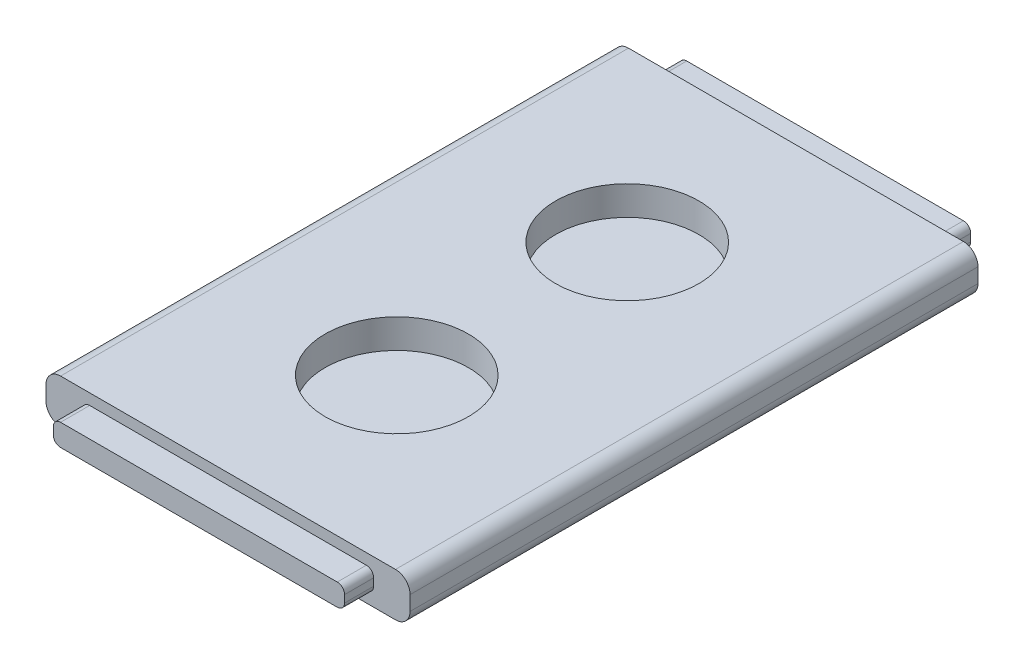
ISO-10303-21;
HEADER;
FILE_DESCRIPTION(('STEP AP214'),'2;1');
FILE_NAME('part.step','',(''),(''),'','','');
FILE_SCHEMA(('AUTOMOTIVE_DESIGN { 1 0 10303 214 1 1 1 1 }'));
ENDSEC;
DATA;
#1=APPLICATION_CONTEXT('core data for automotive mechanical design processes');
#2=APPLICATION_PROTOCOL_DEFINITION('international standard','automotive_design',2000,#1);
#3=PRODUCT_CONTEXT('',#1,'mechanical');
#4=PRODUCT('Part','Part','',(#3));
#5=PRODUCT_RELATED_PRODUCT_CATEGORY('part','',(#4));
#6=PRODUCT_DEFINITION_FORMATION('','',#4);
#7=PRODUCT_DEFINITION_CONTEXT('part definition',#1,'design');
#8=PRODUCT_DEFINITION('design','',#6,#7);
#9=PRODUCT_DEFINITION_SHAPE('','',#8);
#10=(LENGTH_UNIT() NAMED_UNIT(*) SI_UNIT(.MILLI.,.METRE.));
#11=(NAMED_UNIT(*) PLANE_ANGLE_UNIT() SI_UNIT($,.RADIAN.));
#12=(NAMED_UNIT(*) SI_UNIT($,.STERADIAN.) SOLID_ANGLE_UNIT());
#13=UNCERTAINTY_MEASURE_WITH_UNIT(LENGTH_MEASURE(1.E-05),#10,'distance_accuracy_value','');
#14=(GEOMETRIC_REPRESENTATION_CONTEXT(3) GLOBAL_UNCERTAINTY_ASSIGNED_CONTEXT((#13)) GLOBAL_UNIT_ASSIGNED_CONTEXT((#10,
#11,#12)) REPRESENTATION_CONTEXT('',''));
#15=CARTESIAN_POINT('',(0.,0.,0.));
#16=DIRECTION('',(0.,0.,1.));
#17=DIRECTION('',(1.,0.,0.));
#18=AXIS2_PLACEMENT_3D('',#15,#16,#17);
#19=CARTESIAN_POINT('',(-31.75,7.62,-49.53));
#20=DIRECTION('',(0.,0.,1.));
#21=DIRECTION('',(1.,0.,0.));
#22=AXIS2_PLACEMENT_3D('',#19,#20,#21);
#23=PLANE('',#22);
#24=DIRECTION('',(0.,-1.,0.));
#25=VECTOR('',#24,1.);
#26=CARTESIAN_POINT('',(-31.75,7.62,-49.53));
#27=LINE('',#26,#25);
#28=CARTESIAN_POINT('',(-31.75,5.08,-49.53));
#29=VERTEX_POINT('',#28);
#30=CARTESIAN_POINT('',(-31.75,2.54,-49.53));
#31=VERTEX_POINT('',#30);
#32=EDGE_CURVE('E260',#29,#31,#27,.T.);
#33=ORIENTED_EDGE('',*,*,#32,.F.);
#34=CARTESIAN_POINT('',(-29.21,5.08,-49.53));
#35=DIRECTION('',(0.,0.,1.));
#36=DIRECTION('',(1.,0.,0.));
#37=AXIS2_PLACEMENT_3D('',#34,#35,#36);
#38=CIRCLE('',#37,2.54);
#39=CARTESIAN_POINT('',(-29.21,7.62,-49.53));
#40=VERTEX_POINT('',#39);
#41=EDGE_CURVE('E217',#29,#40,#38,.F.);
#42=ORIENTED_EDGE('',*,*,#41,.T.);
#43=DIRECTION('',(-1.,0.,0.));
#44=VECTOR('',#43,1.);
#45=CARTESIAN_POINT('',(-31.75,7.62,-49.53));
#46=LINE('',#45,#44);
#47=CARTESIAN_POINT('',(29.21,7.62,-49.53));
#48=VERTEX_POINT('',#47);
#49=EDGE_CURVE('E225',#48,#40,#46,.T.);
#50=ORIENTED_EDGE('',*,*,#49,.F.);
#51=CARTESIAN_POINT('',(29.21,5.08,-49.53));
#52=DIRECTION('',(0.,0.,1.));
#53=DIRECTION('',(1.,0.,0.));
#54=AXIS2_PLACEMENT_3D('',#51,#52,#53);
#55=CIRCLE('',#54,2.54);
#56=CARTESIAN_POINT('',(31.75,5.08,-49.53));
#57=VERTEX_POINT('',#56);
#58=EDGE_CURVE('E206',#48,#57,#55,.F.);
#59=ORIENTED_EDGE('',*,*,#58,.T.);
#60=DIRECTION('',(0.,-1.,0.));
#61=VECTOR('',#60,1.);
#62=CARTESIAN_POINT('',(31.75,7.62,-49.53));
#63=LINE('',#62,#61);
#64=CARTESIAN_POINT('',(31.75,2.54,-49.53));
#65=VERTEX_POINT('',#64);
#66=EDGE_CURVE('E231',#57,#65,#63,.T.);
#67=ORIENTED_EDGE('',*,*,#66,.T.);
#68=CARTESIAN_POINT('',(29.21,2.54,-49.53));
#69=DIRECTION('',(0.,0.,1.));
#70=DIRECTION('',(1.,0.,0.));
#71=AXIS2_PLACEMENT_3D('',#68,#69,#70);
#72=CIRCLE('',#71,2.54);
#73=CARTESIAN_POINT('',(29.21,0.,-49.53));
#74=VERTEX_POINT('',#73);
#75=EDGE_CURVE('E218',#65,#74,#72,.F.);
#76=ORIENTED_EDGE('',*,*,#75,.T.);
#77=DIRECTION('',(-1.,0.,0.));
#78=VECTOR('',#77,1.);
#79=CARTESIAN_POINT('',(-31.75,0.,-49.53));
#80=LINE('',#79,#78);
#81=CARTESIAN_POINT('',(-29.21,0.,-49.53));
#82=VERTEX_POINT('',#81);
#83=EDGE_CURVE('E243',#74,#82,#80,.T.);
#84=ORIENTED_EDGE('',*,*,#83,.T.);
#85=CARTESIAN_POINT('',(-29.21,2.54,-49.53));
#86=DIRECTION('',(0.,0.,1.));
#87=DIRECTION('',(1.,0.,0.));
#88=AXIS2_PLACEMENT_3D('',#85,#86,#87);
#89=CIRCLE('',#88,2.54);
#90=EDGE_CURVE('E287',#82,#31,#89,.F.);
#91=ORIENTED_EDGE('',*,*,#90,.T.);
#92=EDGE_LOOP('',(#33,#42,#50,#59,#67,#76,#84,#91));
#93=FACE_BOUND('',#92,.T.);
#94=DIRECTION('',(0.,1.,0.));
#95=VECTOR('',#94,1.);
#96=CARTESIAN_POINT('',(-25.4,1.86710349615527,-49.53));
#97=LINE('',#96,#95);
#98=CARTESIAN_POINT('',(-25.4,3.13710349615527,-49.53));
#99=VERTEX_POINT('',#98);
#100=CARTESIAN_POINT('',(-25.4,4.40710349615527,-49.53));
#101=VERTEX_POINT('',#100);
#102=EDGE_CURVE('E406',#99,#101,#97,.T.);
#103=ORIENTED_EDGE('',*,*,#102,.F.);
#104=CARTESIAN_POINT('',(-24.13,3.13710349615527,-49.53));
#105=DIRECTION('',(0.,0.,1.));
#106=DIRECTION('',(1.,0.,0.));
#107=AXIS2_PLACEMENT_3D('',#104,#105,#106);
#108=CIRCLE('',#107,1.27);
#109=CARTESIAN_POINT('',(-24.13,1.86710349615527,-49.53));
#110=VERTEX_POINT('',#109);
#111=EDGE_CURVE('E397',#99,#110,#108,.T.);
#112=ORIENTED_EDGE('',*,*,#111,.T.);
#113=DIRECTION('',(-1.,0.,0.));
#114=VECTOR('',#113,1.);
#115=CARTESIAN_POINT('',(25.4,1.86710349615527,-49.53));
#116=LINE('',#115,#114);
#117=CARTESIAN_POINT('',(24.13,1.86710349615527,-49.53));
#118=VERTEX_POINT('',#117);
#119=EDGE_CURVE('E439',#118,#110,#116,.T.);
#120=ORIENTED_EDGE('',*,*,#119,.F.);
#121=CARTESIAN_POINT('',(24.13,3.13710349615527,-49.53));
#122=DIRECTION('',(0.,0.,1.));
#123=DIRECTION('',(1.,0.,0.));
#124=AXIS2_PLACEMENT_3D('',#121,#122,#123);
#125=CIRCLE('',#124,1.27);
#126=CARTESIAN_POINT('',(25.4,3.13710349615527,-49.53));
#127=VERTEX_POINT('',#126);
#128=EDGE_CURVE('E54',#118,#127,#125,.T.);
#129=ORIENTED_EDGE('',*,*,#128,.T.);
#130=DIRECTION('',(0.,-1.,0.));
#131=VECTOR('',#130,1.);
#132=CARTESIAN_POINT('',(25.4,1.86710349615527,-49.53));
#133=LINE('',#132,#131);
#134=CARTESIAN_POINT('',(25.4,4.40710349615527,-49.53));
#135=VERTEX_POINT('',#134);
#136=EDGE_CURVE('E447',#135,#127,#133,.T.);
#137=ORIENTED_EDGE('',*,*,#136,.F.);
#138=CARTESIAN_POINT('',(24.13,4.40710349615527,-49.53));
#139=DIRECTION('',(0.,0.,1.));
#140=DIRECTION('',(1.,0.,0.));
#141=AXIS2_PLACEMENT_3D('',#138,#139,#140);
#142=CIRCLE('',#141,1.27);
#143=CARTESIAN_POINT('',(24.13,5.67710349615527,-49.53));
#144=VERTEX_POINT('',#143);
#145=EDGE_CURVE('E11',#135,#144,#142,.T.);
#146=ORIENTED_EDGE('',*,*,#145,.T.);
#147=DIRECTION('',(1.,0.,0.));
#148=VECTOR('',#147,1.);
#149=CARTESIAN_POINT('',(25.4,5.67710349615527,-49.53));
#150=LINE('',#149,#148);
#151=CARTESIAN_POINT('',(-24.13,5.67710349615527,-49.53));
#152=VERTEX_POINT('',#151);
#153=EDGE_CURVE('E408',#152,#144,#150,.T.);
#154=ORIENTED_EDGE('',*,*,#153,.F.);
#155=CARTESIAN_POINT('',(-24.13,4.40710349615527,-49.53));
#156=DIRECTION('',(0.,0.,1.));
#157=DIRECTION('',(1.,0.,0.));
#158=AXIS2_PLACEMENT_3D('',#155,#156,#157);
#159=CIRCLE('',#158,1.27);
#160=EDGE_CURVE('E400',#152,#101,#159,.T.);
#161=ORIENTED_EDGE('',*,*,#160,.T.);
#162=EDGE_LOOP('',(#103,#112,#120,#129,#137,#146,#154,#161));
#163=FACE_BOUND('',#162,.T.);
#164=ADVANCED_FACE('F45',(#93,#163),#23,.F.);
#165=CARTESIAN_POINT('',(31.75,7.62,-49.53));
#166=DIRECTION('',(-1.,0.,0.));
#167=DIRECTION('',(0.,0.,1.));
#168=AXIS2_PLACEMENT_3D('',#165,#166,#167);
#169=PLANE('',#168);
#170=ORIENTED_EDGE('',*,*,#66,.F.);
#171=DIRECTION('',(0.,0.,-1.));
#172=VECTOR('',#171,1.);
#173=CARTESIAN_POINT('',(31.75,5.08,49.53));
#174=LINE('',#173,#172);
#175=CARTESIAN_POINT('',(31.75,5.08,49.53));
#176=VERTEX_POINT('',#175);
#177=EDGE_CURVE('E211',#57,#176,#174,.F.);
#178=ORIENTED_EDGE('',*,*,#177,.T.);
#179=DIRECTION('',(0.,-1.,0.));
#180=VECTOR('',#179,1.);
#181=CARTESIAN_POINT('',(31.75,7.62,49.53));
#182=LINE('',#181,#180);
#183=CARTESIAN_POINT('',(31.75,2.54,49.53));
#184=VERTEX_POINT('',#183);
#185=EDGE_CURVE('E240',#176,#184,#182,.T.);
#186=ORIENTED_EDGE('',*,*,#185,.T.);
#187=DIRECTION('',(0.,0.,-1.));
#188=VECTOR('',#187,1.);
#189=CARTESIAN_POINT('',(31.75,2.54,-49.53));
#190=LINE('',#189,#188);
#191=EDGE_CURVE('E294',#184,#65,#190,.T.);
#192=ORIENTED_EDGE('',*,*,#191,.T.);
#193=EDGE_LOOP('',(#170,#178,#186,#192));
#194=FACE_BOUND('',#193,.T.);
#195=ADVANCED_FACE('F515',(#194),#169,.F.);
#196=CARTESIAN_POINT('',(-31.75,7.62,-49.53));
#197=DIRECTION('',(1.,0.,0.));
#198=DIRECTION('',(0.,0.,-1.));
#199=AXIS2_PLACEMENT_3D('',#196,#197,#198);
#200=PLANE('',#199);
#201=DIRECTION('',(0.,-1.,0.));
#202=VECTOR('',#201,1.);
#203=CARTESIAN_POINT('',(-31.75,7.62,49.53));
#204=LINE('',#203,#202);
#205=CARTESIAN_POINT('',(-31.75,5.08,49.53));
#206=VERTEX_POINT('',#205);
#207=CARTESIAN_POINT('',(-31.75,2.54,49.53));
#208=VERTEX_POINT('',#207);
#209=EDGE_CURVE('E256',#206,#208,#204,.T.);
#210=ORIENTED_EDGE('',*,*,#209,.F.);
#211=DIRECTION('',(0.,0.,1.));
#212=VECTOR('',#211,1.);
#213=CARTESIAN_POINT('',(-31.75,5.08,-49.53));
#214=LINE('',#213,#212);
#215=EDGE_CURVE('E284',#206,#29,#214,.F.);
#216=ORIENTED_EDGE('',*,*,#215,.T.);
#217=ORIENTED_EDGE('',*,*,#32,.T.);
#218=DIRECTION('',(0.,0.,1.));
#219=VECTOR('',#218,1.);
#220=CARTESIAN_POINT('',(-31.75,2.54,-49.53));
#221=LINE('',#220,#219);
#222=EDGE_CURVE('E280',#31,#208,#221,.T.);
#223=ORIENTED_EDGE('',*,*,#222,.T.);
#224=EDGE_LOOP('',(#210,#216,#217,#223));
#225=FACE_BOUND('',#224,.T.);
#226=ADVANCED_FACE('F522',(#225),#200,.F.);
#227=CARTESIAN_POINT('',(-31.75,7.62,49.53));
#228=DIRECTION('',(0.,0.,-1.));
#229=DIRECTION('',(-1.,0.,0.));
#230=AXIS2_PLACEMENT_3D('',#227,#228,#229);
#231=PLANE('',#230);
#232=DIRECTION('',(1.,0.,0.));
#233=VECTOR('',#232,1.);
#234=CARTESIAN_POINT('',(-25.4,1.905,49.53));
#235=LINE('',#234,#233);
#236=CARTESIAN_POINT('',(-24.13,1.905,49.53));
#237=VERTEX_POINT('',#236);
#238=CARTESIAN_POINT('',(24.13,1.905,49.53));
#239=VERTEX_POINT('',#238);
#240=EDGE_CURVE('E458',#237,#239,#235,.T.);
#241=ORIENTED_EDGE('',*,*,#240,.F.);
#242=CARTESIAN_POINT('',(-24.13,3.175,49.53));
#243=DIRECTION('',(0.,0.,-1.));
#244=DIRECTION('',(-1.,0.,0.));
#245=AXIS2_PLACEMENT_3D('',#242,#243,#244);
#246=CIRCLE('',#245,1.27);
#247=CARTESIAN_POINT('',(-25.4,3.175,49.53));
#248=VERTEX_POINT('',#247);
#249=EDGE_CURVE('E346',#237,#248,#246,.T.);
#250=ORIENTED_EDGE('',*,*,#249,.T.);
#251=DIRECTION('',(0.,1.,0.));
#252=VECTOR('',#251,1.);
#253=CARTESIAN_POINT('',(-25.4,1.905,49.53));
#254=LINE('',#253,#252);
#255=CARTESIAN_POINT('',(-25.4,4.445,49.53));
#256=VERTEX_POINT('',#255);
#257=EDGE_CURVE('E443',#248,#256,#254,.T.);
#258=ORIENTED_EDGE('',*,*,#257,.T.);
#259=CARTESIAN_POINT('',(-24.13,4.445,49.53));
#260=DIRECTION('',(0.,0.,-1.));
#261=DIRECTION('',(-1.,0.,0.));
#262=AXIS2_PLACEMENT_3D('',#259,#260,#261);
#263=CIRCLE('',#262,1.27);
#264=CARTESIAN_POINT('',(-24.13,5.715,49.53));
#265=VERTEX_POINT('',#264);
#266=EDGE_CURVE('E349',#256,#265,#263,.T.);
#267=ORIENTED_EDGE('',*,*,#266,.T.);
#268=DIRECTION('',(1.,0.,0.));
#269=VECTOR('',#268,1.);
#270=CARTESIAN_POINT('',(-25.4,5.715,49.53));
#271=LINE('',#270,#269);
#272=CARTESIAN_POINT('',(24.13,5.715,49.53));
#273=VERTEX_POINT('',#272);
#274=EDGE_CURVE('E473',#265,#273,#271,.T.);
#275=ORIENTED_EDGE('',*,*,#274,.T.);
#276=CARTESIAN_POINT('',(24.13,4.445,49.53));
#277=DIRECTION('',(0.,0.,-1.));
#278=DIRECTION('',(-1.,0.,0.));
#279=AXIS2_PLACEMENT_3D('',#276,#277,#278);
#280=CIRCLE('',#279,1.27);
#281=CARTESIAN_POINT('',(25.4,4.445,49.53));
#282=VERTEX_POINT('',#281);
#283=EDGE_CURVE('E352',#273,#282,#280,.T.);
#284=ORIENTED_EDGE('',*,*,#283,.T.);
#285=DIRECTION('',(0.,1.,0.));
#286=VECTOR('',#285,1.);
#287=CARTESIAN_POINT('',(25.4,1.905,49.53));
#288=LINE('',#287,#286);
#289=CARTESIAN_POINT('',(25.4,3.175,49.53));
#290=VERTEX_POINT('',#289);
#291=EDGE_CURVE('E477',#290,#282,#288,.T.);
#292=ORIENTED_EDGE('',*,*,#291,.F.);
#293=CARTESIAN_POINT('',(24.13,3.175,49.53));
#294=DIRECTION('',(0.,0.,-1.));
#295=DIRECTION('',(-1.,0.,0.));
#296=AXIS2_PLACEMENT_3D('',#293,#294,#295);
#297=CIRCLE('',#296,1.27);
#298=EDGE_CURVE('E355',#290,#239,#297,.T.);
#299=ORIENTED_EDGE('',*,*,#298,.T.);
#300=EDGE_LOOP('',(#241,#250,#258,#267,#275,#284,#292,#299));
#301=FACE_BOUND('',#300,.T.);
#302=DIRECTION('',(1.,0.,0.));
#303=VECTOR('',#302,1.);
#304=CARTESIAN_POINT('',(-31.75,7.62,49.53));
#305=LINE('',#304,#303);
#306=CARTESIAN_POINT('',(-29.21,7.62,49.53));
#307=VERTEX_POINT('',#306);
#308=CARTESIAN_POINT('',(29.21,7.62,49.53));
#309=VERTEX_POINT('',#308);
#310=EDGE_CURVE('E228',#307,#309,#305,.T.);
#311=ORIENTED_EDGE('',*,*,#310,.F.);
#312=CARTESIAN_POINT('',(-29.21,5.08,49.53));
#313=DIRECTION('',(0.,0.,-1.));
#314=DIRECTION('',(-1.,0.,0.));
#315=AXIS2_PLACEMENT_3D('',#312,#313,#314);
#316=CIRCLE('',#315,2.54);
#317=EDGE_CURVE('E277',#307,#206,#316,.F.);
#318=ORIENTED_EDGE('',*,*,#317,.T.);
#319=ORIENTED_EDGE('',*,*,#209,.T.);
#320=CARTESIAN_POINT('',(-29.21,2.54,49.53));
#321=DIRECTION('',(0.,0.,-1.));
#322=DIRECTION('',(-1.,0.,0.));
#323=AXIS2_PLACEMENT_3D('',#320,#321,#322);
#324=CIRCLE('',#323,2.54);
#325=CARTESIAN_POINT('',(-29.21,0.,49.53));
#326=VERTEX_POINT('',#325);
#327=EDGE_CURVE('E268',#208,#326,#324,.F.);
#328=ORIENTED_EDGE('',*,*,#327,.T.);
#329=DIRECTION('',(1.,0.,0.));
#330=VECTOR('',#329,1.);
#331=CARTESIAN_POINT('',(-31.75,0.,49.53));
#332=LINE('',#331,#330);
#333=CARTESIAN_POINT('',(29.21,0.,49.53));
#334=VERTEX_POINT('',#333);
#335=EDGE_CURVE('E236',#326,#334,#332,.T.);
#336=ORIENTED_EDGE('',*,*,#335,.T.);
#337=CARTESIAN_POINT('',(29.21,2.54,49.53));
#338=DIRECTION('',(0.,0.,-1.));
#339=DIRECTION('',(-1.,0.,0.));
#340=AXIS2_PLACEMENT_3D('',#337,#338,#339);
#341=CIRCLE('',#340,2.54);
#342=EDGE_CURVE('E271',#334,#184,#341,.F.);
#343=ORIENTED_EDGE('',*,*,#342,.T.);
#344=ORIENTED_EDGE('',*,*,#185,.F.);
#345=CARTESIAN_POINT('',(29.21,5.08,49.53));
#346=DIRECTION('',(0.,0.,-1.));
#347=DIRECTION('',(-1.,0.,0.));
#348=AXIS2_PLACEMENT_3D('',#345,#346,#347);
#349=CIRCLE('',#348,2.54);
#350=EDGE_CURVE('E274',#176,#309,#349,.F.);
#351=ORIENTED_EDGE('',*,*,#350,.T.);
#352=EDGE_LOOP('',(#311,#318,#319,#328,#336,#343,#344,#351));
#353=FACE_BOUND('',#352,.T.);
#354=ADVANCED_FACE('F624',(#301,#353),#231,.F.);
#355=CARTESIAN_POINT('',(0.,7.62,0.));
#356=DIRECTION('',(0.,1.,0.));
#357=DIRECTION('',(0.,0.,1.));
#358=AXIS2_PLACEMENT_3D('',#355,#356,#357);
#359=PLANE('',#358);
#360=CARTESIAN_POINT('',(0.,7.62,20.1));
#361=DIRECTION('',(0.,1.,0.));
#362=DIRECTION('',(0.,0.,1.));
#363=AXIS2_PLACEMENT_3D('',#360,#361,#362);
#364=CIRCLE('',#363,12.5);
#365=CARTESIAN_POINT('',(0.,7.62,32.6));
#366=VERTEX_POINT('',#365);
#367=EDGE_CURVE('E487',#366,#366,#364,.T.);
#368=ORIENTED_EDGE('',*,*,#367,.F.);
#369=EDGE_LOOP('',(#368));
#370=FACE_BOUND('',#369,.T.);
#371=CARTESIAN_POINT('',(0.,7.62,-20.1));
#372=DIRECTION('',(0.,1.,0.));
#373=DIRECTION('',(0.,0.,1.));
#374=AXIS2_PLACEMENT_3D('',#371,#372,#373);
#375=CIRCLE('',#374,12.5);
#376=CARTESIAN_POINT('',(0.,7.62,-7.60000000000001));
#377=VERTEX_POINT('',#376);
#378=EDGE_CURVE('E490',#377,#377,#375,.T.);
#379=ORIENTED_EDGE('',*,*,#378,.F.);
#380=EDGE_LOOP('',(#379));
#381=FACE_BOUND('',#380,.T.);
#382=ORIENTED_EDGE('',*,*,#49,.T.);
#383=DIRECTION('',(0.,0.,1.));
#384=VECTOR('',#383,1.);
#385=CARTESIAN_POINT('',(-29.21,7.62,49.53));
#386=LINE('',#385,#384);
#387=EDGE_CURVE('E230',#40,#307,#386,.T.);
#388=ORIENTED_EDGE('',*,*,#387,.T.);
#389=ORIENTED_EDGE('',*,*,#310,.T.);
#390=DIRECTION('',(0.,0.,-1.));
#391=VECTOR('',#390,1.);
#392=CARTESIAN_POINT('',(29.21,7.62,-49.53));
#393=LINE('',#392,#391);
#394=EDGE_CURVE('E210',#309,#48,#393,.T.);
#395=ORIENTED_EDGE('',*,*,#394,.T.);
#396=EDGE_LOOP('',(#382,#388,#389,#395));
#397=FACE_BOUND('',#396,.T.);
#398=ADVANCED_FACE('F223',(#370,#381,#397),#359,.T.);
#399=CARTESIAN_POINT('',(0.,0.,0.));
#400=DIRECTION('',(0.,1.,0.));
#401=DIRECTION('',(0.,0.,1.));
#402=AXIS2_PLACEMENT_3D('',#399,#400,#401);
#403=PLANE('',#402);
#404=ORIENTED_EDGE('',*,*,#83,.F.);
#405=DIRECTION('',(0.,0.,-1.));
#406=VECTOR('',#405,1.);
#407=CARTESIAN_POINT('',(29.21,0.,0.));
#408=LINE('',#407,#406);
#409=EDGE_CURVE('E303',#74,#334,#408,.F.);
#410=ORIENTED_EDGE('',*,*,#409,.T.);
#411=ORIENTED_EDGE('',*,*,#335,.F.);
#412=DIRECTION('',(0.,0.,1.));
#413=VECTOR('',#412,1.);
#414=CARTESIAN_POINT('',(-29.21,0.,0.));
#415=LINE('',#414,#413);
#416=EDGE_CURVE('E300',#326,#82,#415,.F.);
#417=ORIENTED_EDGE('',*,*,#416,.T.);
#418=EDGE_LOOP('',(#404,#410,#411,#417));
#419=FACE_BOUND('',#418,.T.);
#420=ADVANCED_FACE('F503',(#419),#403,.F.);
#421=CARTESIAN_POINT('',(0.,2.54,-20.1));
#422=DIRECTION('',(0.,1.,0.));
#423=DIRECTION('',(0.,0.,1.));
#424=AXIS2_PLACEMENT_3D('',#421,#422,#423);
#425=CYLINDRICAL_SURFACE('',#424,12.5);
#426=CARTESIAN_POINT('',(0.,2.54,-20.1));
#427=DIRECTION('',(0.,1.,0.));
#428=DIRECTION('',(0.,0.,1.));
#429=AXIS2_PLACEMENT_3D('',#426,#427,#428);
#430=CIRCLE('',#429,12.5);
#431=CARTESIAN_POINT('',(0.,2.54,-7.60000000000001));
#432=VERTEX_POINT('',#431);
#433=EDGE_CURVE('E246',#432,#432,#430,.T.);
#434=ORIENTED_EDGE('',*,*,#433,.F.);
#435=EDGE_LOOP('',(#434));
#436=FACE_BOUND('',#435,.T.);
#437=ORIENTED_EDGE('',*,*,#378,.T.);
#438=EDGE_LOOP('',(#437));
#439=FACE_BOUND('',#438,.T.);
#440=ADVANCED_FACE('F501',(#436,#439),#425,.F.);
#441=CARTESIAN_POINT('',(0.,2.54,-20.1));
#442=DIRECTION('',(0.,1.,0.));
#443=DIRECTION('',(0.,0.,1.));
#444=AXIS2_PLACEMENT_3D('',#441,#442,#443);
#445=PLANE('',#444);
#446=ORIENTED_EDGE('',*,*,#433,.T.);
#447=EDGE_LOOP('',(#446));
#448=FACE_BOUND('',#447,.T.);
#449=ADVANCED_FACE('F499',(#448),#445,.T.);
#450=CARTESIAN_POINT('',(0.,2.54,20.1));
#451=DIRECTION('',(0.,1.,0.));
#452=DIRECTION('',(0.,0.,1.));
#453=AXIS2_PLACEMENT_3D('',#450,#451,#452);
#454=CYLINDRICAL_SURFACE('',#453,12.5);
#455=CARTESIAN_POINT('',(0.,2.54,20.1));
#456=DIRECTION('',(0.,1.,0.));
#457=DIRECTION('',(0.,0.,1.));
#458=AXIS2_PLACEMENT_3D('',#455,#456,#457);
#459=CIRCLE('',#458,12.5);
#460=CARTESIAN_POINT('',(0.,2.54,32.6));
#461=VERTEX_POINT('',#460);
#462=EDGE_CURVE('E251',#461,#461,#459,.T.);
#463=ORIENTED_EDGE('',*,*,#462,.F.);
#464=EDGE_LOOP('',(#463));
#465=FACE_BOUND('',#464,.T.);
#466=ORIENTED_EDGE('',*,*,#367,.T.);
#467=EDGE_LOOP('',(#466));
#468=FACE_BOUND('',#467,.T.);
#469=ADVANCED_FACE('F508',(#465,#468),#454,.F.);
#470=CARTESIAN_POINT('',(0.,2.54,20.1));
#471=DIRECTION('',(0.,1.,0.));
#472=DIRECTION('',(0.,0.,1.));
#473=AXIS2_PLACEMENT_3D('',#470,#471,#472);
#474=PLANE('',#473);
#475=ORIENTED_EDGE('',*,*,#462,.T.);
#476=EDGE_LOOP('',(#475));
#477=FACE_BOUND('',#476,.T.);
#478=ADVANCED_FACE('F531',(#477),#474,.T.);
#479=CARTESIAN_POINT('',(-29.21,5.08,0.));
#480=DIRECTION('',(0.,0.,-1.));
#481=DIRECTION('',(-1.,0.,0.));
#482=AXIS2_PLACEMENT_3D('',#479,#480,#481);
#483=CYLINDRICAL_SURFACE('',#482,2.54);
#484=ORIENTED_EDGE('',*,*,#41,.F.);
#485=ORIENTED_EDGE('',*,*,#215,.F.);
#486=ORIENTED_EDGE('',*,*,#317,.F.);
#487=ORIENTED_EDGE('',*,*,#387,.F.);
#488=EDGE_LOOP('',(#484,#485,#486,#487));
#489=FACE_BOUND('',#488,.T.);
#490=ADVANCED_FACE('F528',(#489),#483,.T.);
#491=CARTESIAN_POINT('',(29.21,5.08,0.));
#492=DIRECTION('',(0.,0.,1.));
#493=DIRECTION('',(1.,0.,0.));
#494=AXIS2_PLACEMENT_3D('',#491,#492,#493);
#495=CYLINDRICAL_SURFACE('',#494,2.54);
#496=ORIENTED_EDGE('',*,*,#350,.F.);
#497=ORIENTED_EDGE('',*,*,#177,.F.);
#498=ORIENTED_EDGE('',*,*,#58,.F.);
#499=ORIENTED_EDGE('',*,*,#394,.F.);
#500=EDGE_LOOP('',(#496,#497,#498,#499));
#501=FACE_BOUND('',#500,.T.);
#502=ADVANCED_FACE('F209',(#501),#495,.T.);
#503=CARTESIAN_POINT('',(29.21,2.54,-49.53));
#504=DIRECTION('',(0.,0.,-1.));
#505=DIRECTION('',(-1.,0.,0.));
#506=AXIS2_PLACEMENT_3D('',#503,#504,#505);
#507=CYLINDRICAL_SURFACE('',#506,2.54);
#508=ORIENTED_EDGE('',*,*,#342,.F.);
#509=ORIENTED_EDGE('',*,*,#409,.F.);
#510=ORIENTED_EDGE('',*,*,#75,.F.);
#511=ORIENTED_EDGE('',*,*,#191,.F.);
#512=EDGE_LOOP('',(#508,#509,#510,#511));
#513=FACE_BOUND('',#512,.T.);
#514=ADVANCED_FACE('F535',(#513),#507,.T.);
#515=CARTESIAN_POINT('',(-29.21,2.54,-49.53));
#516=DIRECTION('',(0.,0.,1.));
#517=DIRECTION('',(1.,0.,0.));
#518=AXIS2_PLACEMENT_3D('',#515,#516,#517);
#519=CYLINDRICAL_SURFACE('',#518,2.54);
#520=ORIENTED_EDGE('',*,*,#90,.F.);
#521=ORIENTED_EDGE('',*,*,#416,.F.);
#522=ORIENTED_EDGE('',*,*,#327,.F.);
#523=ORIENTED_EDGE('',*,*,#222,.F.);
#524=EDGE_LOOP('',(#520,#521,#522,#523));
#525=FACE_BOUND('',#524,.T.);
#526=ADVANCED_FACE('F538',(#525),#519,.T.);
#527=CARTESIAN_POINT('',(-25.4,1.905,54.61));
#528=DIRECTION('',(-1.,0.,0.));
#529=DIRECTION('',(0.,0.,1.));
#530=AXIS2_PLACEMENT_3D('',#527,#528,#529);
#531=PLANE('',#530);
#532=ORIENTED_EDGE('',*,*,#257,.F.);
#533=DIRECTION('',(0.,0.,-1.));
#534=VECTOR('',#533,1.);
#535=CARTESIAN_POINT('',(-25.4,3.175,54.61));
#536=LINE('',#535,#534);
#537=CARTESIAN_POINT('',(-25.4,3.175,54.61));
#538=VERTEX_POINT('',#537);
#539=EDGE_CURVE('E317',#248,#538,#536,.F.);
#540=ORIENTED_EDGE('',*,*,#539,.T.);
#541=DIRECTION('',(0.,1.,0.));
#542=VECTOR('',#541,1.);
#543=CARTESIAN_POINT('',(-25.4,1.905,54.61));
#544=LINE('',#543,#542);
#545=CARTESIAN_POINT('',(-25.4,4.445,54.61));
#546=VERTEX_POINT('',#545);
#547=EDGE_CURVE('E453',#538,#546,#544,.T.);
#548=ORIENTED_EDGE('',*,*,#547,.T.);
#549=DIRECTION('',(0.,0.,-1.));
#550=VECTOR('',#549,1.);
#551=CARTESIAN_POINT('',(-25.4,4.445,54.61));
#552=LINE('',#551,#550);
#553=EDGE_CURVE('E313',#546,#256,#552,.T.);
#554=ORIENTED_EDGE('',*,*,#553,.T.);
#555=EDGE_LOOP('',(#532,#540,#548,#554));
#556=FACE_BOUND('',#555,.T.);
#557=ADVANCED_FACE('F542',(#556),#531,.T.);
#558=CARTESIAN_POINT('',(-25.4,1.905,54.61));
#559=DIRECTION('',(0.,1.,0.));
#560=DIRECTION('',(0.,0.,1.));
#561=AXIS2_PLACEMENT_3D('',#558,#559,#560);
#562=PLANE('',#561);
#563=DIRECTION('',(1.,0.,0.));
#564=VECTOR('',#563,1.);
#565=CARTESIAN_POINT('',(-25.4,1.905,54.61));
#566=LINE('',#565,#564);
#567=CARTESIAN_POINT('',(-24.13,1.905,54.61));
#568=VERTEX_POINT('',#567);
#569=CARTESIAN_POINT('',(24.13,1.905,54.61));
#570=VERTEX_POINT('',#569);
#571=EDGE_CURVE('E466',#568,#570,#566,.T.);
#572=ORIENTED_EDGE('',*,*,#571,.F.);
#573=DIRECTION('',(0.,0.,-1.));
#574=VECTOR('',#573,1.);
#575=CARTESIAN_POINT('',(-24.13,1.905,49.53));
#576=LINE('',#575,#574);
#577=EDGE_CURVE('E309',#568,#237,#576,.T.);
#578=ORIENTED_EDGE('',*,*,#577,.T.);
#579=ORIENTED_EDGE('',*,*,#240,.T.);
#580=DIRECTION('',(0.,0.,-1.));
#581=VECTOR('',#580,1.);
#582=CARTESIAN_POINT('',(24.13,1.905,54.61));
#583=LINE('',#582,#581);
#584=EDGE_CURVE('E306',#239,#570,#583,.F.);
#585=ORIENTED_EDGE('',*,*,#584,.T.);
#586=EDGE_LOOP('',(#572,#578,#579,#585));
#587=FACE_BOUND('',#586,.T.);
#588=ADVANCED_FACE('F598',(#587),#562,.F.);
#589=CARTESIAN_POINT('',(25.4,1.905,54.61));
#590=DIRECTION('',(-1.,0.,0.));
#591=DIRECTION('',(0.,0.,1.));
#592=AXIS2_PLACEMENT_3D('',#589,#590,#591);
#593=PLANE('',#592);
#594=ORIENTED_EDGE('',*,*,#291,.T.);
#595=DIRECTION('',(0.,0.,-1.));
#596=VECTOR('',#595,1.);
#597=CARTESIAN_POINT('',(25.4,4.445,54.61));
#598=LINE('',#597,#596);
#599=CARTESIAN_POINT('',(25.4,4.445,54.61));
#600=VERTEX_POINT('',#599);
#601=EDGE_CURVE('E343',#282,#600,#598,.F.);
#602=ORIENTED_EDGE('',*,*,#601,.T.);
#603=DIRECTION('',(0.,1.,0.));
#604=VECTOR('',#603,1.);
#605=CARTESIAN_POINT('',(25.4,1.905,54.61));
#606=LINE('',#605,#604);
#607=CARTESIAN_POINT('',(25.4,3.175,54.61));
#608=VERTEX_POINT('',#607);
#609=EDGE_CURVE('E462',#608,#600,#606,.T.);
#610=ORIENTED_EDGE('',*,*,#609,.F.);
#611=DIRECTION('',(0.,0.,-1.));
#612=VECTOR('',#611,1.);
#613=CARTESIAN_POINT('',(25.4,3.175,54.61));
#614=LINE('',#613,#612);
#615=EDGE_CURVE('E339',#608,#290,#614,.T.);
#616=ORIENTED_EDGE('',*,*,#615,.T.);
#617=EDGE_LOOP('',(#594,#602,#610,#616));
#618=FACE_BOUND('',#617,.T.);
#619=ADVANCED_FACE('F601',(#618),#593,.F.);
#620=CARTESIAN_POINT('',(-25.4,5.715,54.61));
#621=DIRECTION('',(0.,1.,0.));
#622=DIRECTION('',(0.,0.,1.));
#623=AXIS2_PLACEMENT_3D('',#620,#621,#622);
#624=PLANE('',#623);
#625=ORIENTED_EDGE('',*,*,#274,.F.);
#626=DIRECTION('',(0.,0.,-1.));
#627=VECTOR('',#626,1.);
#628=CARTESIAN_POINT('',(-24.13,5.715,54.61));
#629=LINE('',#628,#627);
#630=CARTESIAN_POINT('',(-24.13,5.715,54.61));
#631=VERTEX_POINT('',#630);
#632=EDGE_CURVE('E336',#265,#631,#629,.F.);
#633=ORIENTED_EDGE('',*,*,#632,.T.);
#634=DIRECTION('',(1.,0.,0.));
#635=VECTOR('',#634,1.);
#636=CARTESIAN_POINT('',(-25.4,5.715,54.61));
#637=LINE('',#636,#635);
#638=CARTESIAN_POINT('',(24.13,5.715,54.61));
#639=VERTEX_POINT('',#638);
#640=EDGE_CURVE('E457',#631,#639,#637,.T.);
#641=ORIENTED_EDGE('',*,*,#640,.T.);
#642=DIRECTION('',(0.,0.,-1.));
#643=VECTOR('',#642,1.);
#644=CARTESIAN_POINT('',(24.13,5.715,49.53));
#645=LINE('',#644,#643);
#646=EDGE_CURVE('E332',#639,#273,#645,.T.);
#647=ORIENTED_EDGE('',*,*,#646,.T.);
#648=EDGE_LOOP('',(#625,#633,#641,#647));
#649=FACE_BOUND('',#648,.T.);
#650=ADVANCED_FACE('F596',(#649),#624,.T.);
#651=CARTESIAN_POINT('',(0.,0.,54.61));
#652=DIRECTION('',(0.,0.,-1.));
#653=DIRECTION('',(-1.,0.,0.));
#654=AXIS2_PLACEMENT_3D('',#651,#652,#653);
#655=PLANE('',#654);
#656=ORIENTED_EDGE('',*,*,#547,.F.);
#657=CARTESIAN_POINT('',(-24.13,3.175,54.61));
#658=DIRECTION('',(0.,0.,-1.));
#659=DIRECTION('',(-1.,0.,0.));
#660=AXIS2_PLACEMENT_3D('',#657,#658,#659);
#661=CIRCLE('',#660,1.27);
#662=EDGE_CURVE('E329',#538,#568,#661,.F.);
#663=ORIENTED_EDGE('',*,*,#662,.T.);
#664=ORIENTED_EDGE('',*,*,#571,.T.);
#665=CARTESIAN_POINT('',(24.13,3.175,54.61));
#666=DIRECTION('',(0.,0.,-1.));
#667=DIRECTION('',(-1.,0.,0.));
#668=AXIS2_PLACEMENT_3D('',#665,#666,#667);
#669=CIRCLE('',#668,1.27);
#670=EDGE_CURVE('E320',#570,#608,#669,.F.);
#671=ORIENTED_EDGE('',*,*,#670,.T.);
#672=ORIENTED_EDGE('',*,*,#609,.T.);
#673=CARTESIAN_POINT('',(24.13,4.445,54.61));
#674=DIRECTION('',(0.,0.,-1.));
#675=DIRECTION('',(-1.,0.,0.));
#676=AXIS2_PLACEMENT_3D('',#673,#674,#675);
#677=CIRCLE('',#676,1.27);
#678=EDGE_CURVE('E323',#600,#639,#677,.F.);
#679=ORIENTED_EDGE('',*,*,#678,.T.);
#680=ORIENTED_EDGE('',*,*,#640,.F.);
#681=CARTESIAN_POINT('',(-24.13,4.445,54.61));
#682=DIRECTION('',(0.,0.,-1.));
#683=DIRECTION('',(-1.,0.,0.));
#684=AXIS2_PLACEMENT_3D('',#681,#682,#683);
#685=CIRCLE('',#684,1.27);
#686=EDGE_CURVE('E326',#631,#546,#685,.F.);
#687=ORIENTED_EDGE('',*,*,#686,.T.);
#688=EDGE_LOOP('',(#656,#663,#664,#671,#672,#679,#680,#687));
#689=FACE_BOUND('',#688,.T.);
#690=ADVANCED_FACE('F548',(#689),#655,.F.);
#691=CARTESIAN_POINT('',(-24.13,3.175,54.61));
#692=DIRECTION('',(0.,0.,1.));
#693=DIRECTION('',(1.,0.,0.));
#694=AXIS2_PLACEMENT_3D('',#691,#692,#693);
#695=CYLINDRICAL_SURFACE('',#694,1.27);
#696=ORIENTED_EDGE('',*,*,#662,.F.);
#697=ORIENTED_EDGE('',*,*,#539,.F.);
#698=ORIENTED_EDGE('',*,*,#249,.F.);
#699=ORIENTED_EDGE('',*,*,#577,.F.);
#700=EDGE_LOOP('',(#696,#697,#698,#699));
#701=FACE_BOUND('',#700,.T.);
#702=ADVANCED_FACE('F544',(#701),#695,.T.);
#703=CARTESIAN_POINT('',(-24.13,4.445,54.61));
#704=DIRECTION('',(0.,0.,-1.));
#705=DIRECTION('',(-1.,0.,0.));
#706=AXIS2_PLACEMENT_3D('',#703,#704,#705);
#707=CYLINDRICAL_SURFACE('',#706,1.27);
#708=ORIENTED_EDGE('',*,*,#686,.F.);
#709=ORIENTED_EDGE('',*,*,#632,.F.);
#710=ORIENTED_EDGE('',*,*,#266,.F.);
#711=ORIENTED_EDGE('',*,*,#553,.F.);
#712=EDGE_LOOP('',(#708,#709,#710,#711));
#713=FACE_BOUND('',#712,.T.);
#714=ADVANCED_FACE('F547',(#713),#707,.T.);
#715=CARTESIAN_POINT('',(24.13,4.445,54.61));
#716=DIRECTION('',(0.,0.,1.));
#717=DIRECTION('',(1.,0.,0.));
#718=AXIS2_PLACEMENT_3D('',#715,#716,#717);
#719=CYLINDRICAL_SURFACE('',#718,1.27);
#720=ORIENTED_EDGE('',*,*,#678,.F.);
#721=ORIENTED_EDGE('',*,*,#601,.F.);
#722=ORIENTED_EDGE('',*,*,#283,.F.);
#723=ORIENTED_EDGE('',*,*,#646,.F.);
#724=EDGE_LOOP('',(#720,#721,#722,#723));
#725=FACE_BOUND('',#724,.T.);
#726=ADVANCED_FACE('F552',(#725),#719,.T.);
#727=CARTESIAN_POINT('',(24.13,3.175,54.61));
#728=DIRECTION('',(0.,0.,-1.));
#729=DIRECTION('',(-1.,0.,0.));
#730=AXIS2_PLACEMENT_3D('',#727,#728,#729);
#731=CYLINDRICAL_SURFACE('',#730,1.27);
#732=ORIENTED_EDGE('',*,*,#670,.F.);
#733=ORIENTED_EDGE('',*,*,#584,.F.);
#734=ORIENTED_EDGE('',*,*,#298,.F.);
#735=ORIENTED_EDGE('',*,*,#615,.F.);
#736=EDGE_LOOP('',(#732,#733,#734,#735));
#737=FACE_BOUND('',#736,.T.);
#738=ADVANCED_FACE('F556',(#737),#731,.T.);
#739=CARTESIAN_POINT('',(-25.4,1.86710349615527,-54.61));
#740=DIRECTION('',(1.,0.,0.));
#741=DIRECTION('',(0.,0.,-1.));
#742=AXIS2_PLACEMENT_3D('',#739,#740,#741);
#743=PLANE('',#742);
#744=DIRECTION('',(0.,1.,0.));
#745=VECTOR('',#744,1.);
#746=CARTESIAN_POINT('',(-25.4,1.86710349615527,-54.61));
#747=LINE('',#746,#745);
#748=CARTESIAN_POINT('',(-25.4,3.13710349615527,-54.61));
#749=VERTEX_POINT('',#748);
#750=CARTESIAN_POINT('',(-25.4,4.40710349615527,-54.61));
#751=VERTEX_POINT('',#750);
#752=EDGE_CURVE('E428',#749,#751,#747,.T.);
#753=ORIENTED_EDGE('',*,*,#752,.F.);
#754=DIRECTION('',(0.,0.,1.));
#755=VECTOR('',#754,1.);
#756=CARTESIAN_POINT('',(-25.4,3.13710349615527,-54.61));
#757=LINE('',#756,#755);
#758=EDGE_CURVE('E361',#749,#99,#757,.T.);
#759=ORIENTED_EDGE('',*,*,#758,.T.);
#760=ORIENTED_EDGE('',*,*,#102,.T.);
#761=DIRECTION('',(0.,0.,1.));
#762=VECTOR('',#761,1.);
#763=CARTESIAN_POINT('',(-25.4,4.40710349615527,-54.61));
#764=LINE('',#763,#762);
#765=EDGE_CURVE('E358',#101,#751,#764,.F.);
#766=ORIENTED_EDGE('',*,*,#765,.T.);
#767=EDGE_LOOP('',(#753,#759,#760,#766));
#768=FACE_BOUND('',#767,.T.);
#769=ADVANCED_FACE('F414',(#768),#743,.F.);
#770=CARTESIAN_POINT('',(25.4,5.67710349615527,-54.61));
#771=DIRECTION('',(0.,-1.,0.));
#772=DIRECTION('',(0.,0.,-1.));
#773=AXIS2_PLACEMENT_3D('',#770,#771,#772);
#774=PLANE('',#773);
#775=DIRECTION('',(1.,0.,0.));
#776=VECTOR('',#775,1.);
#777=CARTESIAN_POINT('',(25.4,5.67710349615527,-54.61));
#778=LINE('',#777,#776);
#779=CARTESIAN_POINT('',(-24.13,5.67710349615527,-54.61));
#780=VERTEX_POINT('',#779);
#781=CARTESIAN_POINT('',(24.13,5.67710349615527,-54.61));
#782=VERTEX_POINT('',#781);
#783=EDGE_CURVE('E426',#780,#782,#778,.T.);
#784=ORIENTED_EDGE('',*,*,#783,.F.);
#785=DIRECTION('',(0.,0.,1.));
#786=VECTOR('',#785,1.);
#787=CARTESIAN_POINT('',(-24.13,5.67710349615527,-54.61));
#788=LINE('',#787,#786);
#789=EDGE_CURVE('E387',#780,#152,#788,.T.);
#790=ORIENTED_EDGE('',*,*,#789,.T.);
#791=ORIENTED_EDGE('',*,*,#153,.T.);
#792=DIRECTION('',(0.,0.,1.));
#793=VECTOR('',#792,1.);
#794=CARTESIAN_POINT('',(24.13,5.67710349615527,-54.61));
#795=LINE('',#794,#793);
#796=EDGE_CURVE('E384',#144,#782,#795,.F.);
#797=ORIENTED_EDGE('',*,*,#796,.T.);
#798=EDGE_LOOP('',(#784,#790,#791,#797));
#799=FACE_BOUND('',#798,.T.);
#800=ADVANCED_FACE('F430',(#799),#774,.F.);
#801=CARTESIAN_POINT('',(25.4,1.86710349615527,-54.61));
#802=DIRECTION('',(-1.,0.,0.));
#803=DIRECTION('',(0.,0.,1.));
#804=AXIS2_PLACEMENT_3D('',#801,#802,#803);
#805=PLANE('',#804);
#806=ORIENTED_EDGE('',*,*,#136,.T.);
#807=DIRECTION('',(0.,0.,1.));
#808=VECTOR('',#807,1.);
#809=CARTESIAN_POINT('',(25.4,3.13710349615527,-54.61));
#810=LINE('',#809,#808);
#811=CARTESIAN_POINT('',(25.4,3.13710349615527,-54.61));
#812=VERTEX_POINT('',#811);
#813=EDGE_CURVE('E394',#127,#812,#810,.F.);
#814=ORIENTED_EDGE('',*,*,#813,.T.);
#815=DIRECTION('',(0.,-1.,0.));
#816=VECTOR('',#815,1.);
#817=CARTESIAN_POINT('',(25.4,1.86710349615527,-54.61));
#818=LINE('',#817,#816);
#819=CARTESIAN_POINT('',(25.4,4.40710349615527,-54.61));
#820=VERTEX_POINT('',#819);
#821=EDGE_CURVE('E432',#820,#812,#818,.T.);
#822=ORIENTED_EDGE('',*,*,#821,.F.);
#823=DIRECTION('',(0.,0.,1.));
#824=VECTOR('',#823,1.);
#825=CARTESIAN_POINT('',(25.4,4.40710349615527,-54.61));
#826=LINE('',#825,#824);
#827=EDGE_CURVE('E391',#820,#135,#826,.T.);
#828=ORIENTED_EDGE('',*,*,#827,.T.);
#829=EDGE_LOOP('',(#806,#814,#822,#828));
#830=FACE_BOUND('',#829,.T.);
#831=ADVANCED_FACE('F581',(#830),#805,.F.);
#832=CARTESIAN_POINT('',(25.4,1.86710349615527,-54.61));
#833=DIRECTION('',(0.,1.,0.));
#834=DIRECTION('',(0.,0.,1.));
#835=AXIS2_PLACEMENT_3D('',#832,#833,#834);
#836=PLANE('',#835);
#837=ORIENTED_EDGE('',*,*,#119,.T.);
#838=DIRECTION('',(0.,0.,1.));
#839=VECTOR('',#838,1.);
#840=CARTESIAN_POINT('',(-24.13,1.86710349615527,-54.61));
#841=LINE('',#840,#839);
#842=CARTESIAN_POINT('',(-24.13,1.86710349615527,-54.61));
#843=VERTEX_POINT('',#842);
#844=EDGE_CURVE('E369',#110,#843,#841,.F.);
#845=ORIENTED_EDGE('',*,*,#844,.T.);
#846=DIRECTION('',(-1.,0.,0.));
#847=VECTOR('',#846,1.);
#848=CARTESIAN_POINT('',(25.4,1.86710349615527,-54.61));
#849=LINE('',#848,#847);
#850=CARTESIAN_POINT('',(24.13,1.86710349615527,-54.61));
#851=VERTEX_POINT('',#850);
#852=EDGE_CURVE('E437',#851,#843,#849,.T.);
#853=ORIENTED_EDGE('',*,*,#852,.F.);
#854=DIRECTION('',(0.,0.,1.));
#855=VECTOR('',#854,1.);
#856=CARTESIAN_POINT('',(24.13,1.86710349615527,-54.61));
#857=LINE('',#856,#855);
#858=EDGE_CURVE('E365',#851,#118,#857,.T.);
#859=ORIENTED_EDGE('',*,*,#858,.T.);
#860=EDGE_LOOP('',(#837,#845,#853,#859));
#861=FACE_BOUND('',#860,.T.);
#862=ADVANCED_FACE('F578',(#861),#836,.F.);
#863=CARTESIAN_POINT('',(0.,0.,-54.61));
#864=DIRECTION('',(0.,0.,1.));
#865=DIRECTION('',(1.,0.,0.));
#866=AXIS2_PLACEMENT_3D('',#863,#864,#865);
#867=PLANE('',#866);
#868=ORIENTED_EDGE('',*,*,#852,.T.);
#869=CARTESIAN_POINT('',(-24.13,3.13710349615527,-54.61));
#870=DIRECTION('',(0.,0.,1.));
#871=DIRECTION('',(1.,0.,0.));
#872=AXIS2_PLACEMENT_3D('',#869,#870,#871);
#873=CIRCLE('',#872,1.27);
#874=EDGE_CURVE('E381',#843,#749,#873,.F.);
#875=ORIENTED_EDGE('',*,*,#874,.T.);
#876=ORIENTED_EDGE('',*,*,#752,.T.);
#877=CARTESIAN_POINT('',(-24.13,4.40710349615527,-54.61));
#878=DIRECTION('',(0.,0.,1.));
#879=DIRECTION('',(1.,0.,0.));
#880=AXIS2_PLACEMENT_3D('',#877,#878,#879);
#881=CIRCLE('',#880,1.27);
#882=EDGE_CURVE('E378',#751,#780,#881,.F.);
#883=ORIENTED_EDGE('',*,*,#882,.T.);
#884=ORIENTED_EDGE('',*,*,#783,.T.);
#885=CARTESIAN_POINT('',(24.13,4.40710349615527,-54.61));
#886=DIRECTION('',(0.,0.,1.));
#887=DIRECTION('',(1.,0.,0.));
#888=AXIS2_PLACEMENT_3D('',#885,#886,#887);
#889=CIRCLE('',#888,1.27);
#890=EDGE_CURVE('E372',#782,#820,#889,.F.);
#891=ORIENTED_EDGE('',*,*,#890,.T.);
#892=ORIENTED_EDGE('',*,*,#821,.T.);
#893=CARTESIAN_POINT('',(24.13,3.13710349615527,-54.61));
#894=DIRECTION('',(0.,0.,1.));
#895=DIRECTION('',(1.,0.,0.));
#896=AXIS2_PLACEMENT_3D('',#893,#894,#895);
#897=CIRCLE('',#896,1.27);
#898=EDGE_CURVE('E375',#812,#851,#897,.F.);
#899=ORIENTED_EDGE('',*,*,#898,.T.);
#900=EDGE_LOOP('',(#868,#875,#876,#883,#884,#891,#892,#899));
#901=FACE_BOUND('',#900,.T.);
#902=ADVANCED_FACE('F425',(#901),#867,.F.);
#903=CARTESIAN_POINT('',(-24.13,3.13710349615527,-54.61));
#904=DIRECTION('',(0.,0.,1.));
#905=DIRECTION('',(1.,0.,0.));
#906=AXIS2_PLACEMENT_3D('',#903,#904,#905);
#907=CYLINDRICAL_SURFACE('',#906,1.27);
#908=ORIENTED_EDGE('',*,*,#874,.F.);
#909=ORIENTED_EDGE('',*,*,#844,.F.);
#910=ORIENTED_EDGE('',*,*,#111,.F.);
#911=ORIENTED_EDGE('',*,*,#758,.F.);
#912=EDGE_LOOP('',(#908,#909,#910,#911));
#913=FACE_BOUND('',#912,.T.);
#914=ADVANCED_FACE('F560',(#913),#907,.T.);
#915=CARTESIAN_POINT('',(-24.13,4.40710349615527,-54.61));
#916=DIRECTION('',(0.,0.,1.));
#917=DIRECTION('',(1.,0.,0.));
#918=AXIS2_PLACEMENT_3D('',#915,#916,#917);
#919=CYLINDRICAL_SURFACE('',#918,1.27);
#920=ORIENTED_EDGE('',*,*,#882,.F.);
#921=ORIENTED_EDGE('',*,*,#765,.F.);
#922=ORIENTED_EDGE('',*,*,#160,.F.);
#923=ORIENTED_EDGE('',*,*,#789,.F.);
#924=EDGE_LOOP('',(#920,#921,#922,#923));
#925=FACE_BOUND('',#924,.T.);
#926=ADVANCED_FACE('F420',(#925),#919,.T.);
#927=CARTESIAN_POINT('',(24.13,3.13710349615527,-54.61));
#928=DIRECTION('',(0.,0.,1.));
#929=DIRECTION('',(1.,0.,0.));
#930=AXIS2_PLACEMENT_3D('',#927,#928,#929);
#931=CYLINDRICAL_SURFACE('',#930,1.27);
#932=ORIENTED_EDGE('',*,*,#898,.F.);
#933=ORIENTED_EDGE('',*,*,#813,.F.);
#934=ORIENTED_EDGE('',*,*,#128,.F.);
#935=ORIENTED_EDGE('',*,*,#858,.F.);
#936=EDGE_LOOP('',(#932,#933,#934,#935));
#937=FACE_BOUND('',#936,.T.);
#938=ADVANCED_FACE('F565',(#937),#931,.T.);
#939=CARTESIAN_POINT('',(24.13,4.40710349615527,-54.61));
#940=DIRECTION('',(0.,0.,1.));
#941=DIRECTION('',(1.,0.,0.));
#942=AXIS2_PLACEMENT_3D('',#939,#940,#941);
#943=CYLINDRICAL_SURFACE('',#942,1.27);
#944=ORIENTED_EDGE('',*,*,#890,.F.);
#945=ORIENTED_EDGE('',*,*,#796,.F.);
#946=ORIENTED_EDGE('',*,*,#145,.F.);
#947=ORIENTED_EDGE('',*,*,#827,.F.);
#948=EDGE_LOOP('',(#944,#945,#946,#947));
#949=FACE_BOUND('',#948,.T.);
#950=ADVANCED_FACE('F47',(#949),#943,.T.);
#951=CLOSED_SHELL('',(#164,#195,#226,#354,#398,#420,#440,#449,#469,#478,#490,#502,#514,#526,
#557,#588,#619,#650,#690,#702,#714,#726,#738,#769,#800,#831,#862,#902,#914,#926,#938,#950));
#952=MANIFOLD_SOLID_BREP('B2',#951);
#953=ADVANCED_BREP_SHAPE_REPRESENTATION('',(#18,#952),#14);
#954=SHAPE_DEFINITION_REPRESENTATION(#9,#953);
ENDSEC;
END-ISO-10303-21;
